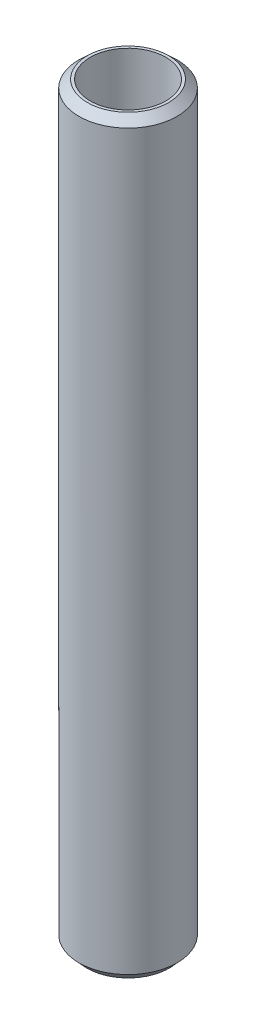
ISO-10303-21;
HEADER;
FILE_DESCRIPTION(('STEP AP214'),'2;1');
FILE_NAME('part.step','',(''),(''),'','','');
FILE_SCHEMA(('AUTOMOTIVE_DESIGN { 1 0 10303 214 1 1 1 1 }'));
ENDSEC;
DATA;
#1=APPLICATION_CONTEXT('core data for automotive mechanical design processes');
#2=APPLICATION_PROTOCOL_DEFINITION('international standard','automotive_design',2000,#1);
#3=PRODUCT_CONTEXT('',#1,'mechanical');
#4=PRODUCT('Part','Part','',(#3));
#5=PRODUCT_RELATED_PRODUCT_CATEGORY('part','',(#4));
#6=PRODUCT_DEFINITION_FORMATION('','',#4);
#7=PRODUCT_DEFINITION_CONTEXT('part definition',#1,'design');
#8=PRODUCT_DEFINITION('design','',#6,#7);
#9=PRODUCT_DEFINITION_SHAPE('','',#8);
#10=(LENGTH_UNIT() NAMED_UNIT(*) SI_UNIT(.MILLI.,.METRE.));
#11=(NAMED_UNIT(*) PLANE_ANGLE_UNIT() SI_UNIT($,.RADIAN.));
#12=(NAMED_UNIT(*) SI_UNIT($,.STERADIAN.) SOLID_ANGLE_UNIT());
#13=UNCERTAINTY_MEASURE_WITH_UNIT(LENGTH_MEASURE(1.E-05),#10,'distance_accuracy_value','');
#14=(GEOMETRIC_REPRESENTATION_CONTEXT(3) GLOBAL_UNCERTAINTY_ASSIGNED_CONTEXT((#13)) GLOBAL_UNIT_ASSIGNED_CONTEXT((#10,
#11,#12)) REPRESENTATION_CONTEXT('',''));
#15=CARTESIAN_POINT('',(0.,0.,0.));
#16=DIRECTION('',(0.,0.,1.));
#17=DIRECTION('',(1.,0.,0.));
#18=AXIS2_PLACEMENT_3D('',#15,#16,#17);
#19=CARTESIAN_POINT('',(0.,343.666464801404,0.));
#20=DIRECTION('',(0.,-1.,0.));
#21=DIRECTION('',(0.,0.,-1.));
#22=AXIS2_PLACEMENT_3D('',#19,#20,#21);
#23=CYLINDRICAL_SURFACE('',#22,22.5);
#24=CARTESIAN_POINT('',(0.,340.098776396544,0.));
#25=DIRECTION('',(0.,1.,0.));
#26=DIRECTION('',(0.,0.,1.));
#27=AXIS2_PLACEMENT_3D('',#24,#25,#26);
#28=CIRCLE('',#27,22.5);
#29=CARTESIAN_POINT('',(0.,340.098776396544,-22.5));
#30=VERTEX_POINT('',#29);
#31=EDGE_CURVE('E50',#30,#30,#28,.F.);
#32=CARTESIAN_POINT('',(0.,3.87043361719264,0.));
#33=DIRECTION('',(0.,1.,0.));
#34=DIRECTION('',(0.,0.,1.));
#35=AXIS2_PLACEMENT_3D('',#32,#33,#34);
#36=CIRCLE('',#35,22.5);
#37=CARTESIAN_POINT('',(0.,3.87043361719258,-22.5));
#38=VERTEX_POINT('',#37);
#39=EDGE_CURVE('E51',#38,#38,#36,.T.);
#40=CARTESIAN_POINT('',(0.,340.098776396544,-22.5));
#41=CARTESIAN_POINT('',(0.,336.596397825925,-22.5));
#42=CARTESIAN_POINT('',(0.,333.094019255307,-22.5));
#43=CARTESIAN_POINT('',(0.,326.089262114071,-22.5));
#44=CARTESIAN_POINT('',(0.,322.586883543452,-22.5));
#45=CARTESIAN_POINT('',(0.,315.582126402216,-22.5));
#46=CARTESIAN_POINT('',(0.,312.079747831598,-22.5));
#47=CARTESIAN_POINT('',(0.,305.074990690361,-22.5));
#48=CARTESIAN_POINT('',(0.,301.572612119743,-22.5));
#49=CARTESIAN_POINT('',(0.,294.567854978507,-22.5));
#50=CARTESIAN_POINT('',(0.,291.065476407888,-22.5));
#51=CARTESIAN_POINT('',(0.,284.060719266652,-22.5));
#52=CARTESIAN_POINT('',(0.,280.558340696034,-22.5));
#53=CARTESIAN_POINT('',(0.,273.553583554797,-22.5));
#54=CARTESIAN_POINT('',(0.,270.051204984179,-22.5));
#55=CARTESIAN_POINT('',(0.,263.046447842942,-22.5));
#56=CARTESIAN_POINT('',(0.,259.544069272324,-22.5));
#57=CARTESIAN_POINT('',(0.,252.539312131088,-22.5));
#58=CARTESIAN_POINT('',(0.,249.036933560469,-22.5));
#59=CARTESIAN_POINT('',(0.,242.032176419233,-22.5));
#60=CARTESIAN_POINT('',(0.,238.529797848615,-22.5));
#61=CARTESIAN_POINT('',(0.,231.525040707378,-22.5));
#62=CARTESIAN_POINT('',(0.,228.02266213676,-22.5));
#63=CARTESIAN_POINT('',(0.,221.017904995524,-22.5));
#64=CARTESIAN_POINT('',(0.,217.515526424905,-22.5));
#65=CARTESIAN_POINT('',(0.,210.510769283669,-22.5));
#66=CARTESIAN_POINT('',(0.,207.008390713051,-22.5));
#67=CARTESIAN_POINT('',(0.,200.003633571814,-22.5));
#68=CARTESIAN_POINT('',(0.,196.501255001196,-22.5));
#69=CARTESIAN_POINT('',(0.,189.496497859959,-22.5));
#70=CARTESIAN_POINT('',(0.,185.994119289341,-22.5));
#71=CARTESIAN_POINT('',(0.,178.989362148105,-22.5));
#72=CARTESIAN_POINT('',(0.,175.486983577486,-22.5));
#73=CARTESIAN_POINT('',(0.,168.48222643625,-22.5));
#74=CARTESIAN_POINT('',(0.,164.979847865632,-22.5));
#75=CARTESIAN_POINT('',(0.,157.975090724395,-22.5));
#76=CARTESIAN_POINT('',(0.,154.472712153777,-22.5));
#77=CARTESIAN_POINT('',(0.,147.46795501254,-22.5));
#78=CARTESIAN_POINT('',(0.,143.965576441922,-22.5));
#79=CARTESIAN_POINT('',(0.,136.960819300686,-22.5));
#80=CARTESIAN_POINT('',(0.,133.458440730068,-22.5));
#81=CARTESIAN_POINT('',(0.,126.453683588831,-22.5));
#82=CARTESIAN_POINT('',(0.,122.951305018213,-22.5));
#83=CARTESIAN_POINT('',(0.,115.946547876976,-22.5));
#84=CARTESIAN_POINT('',(0.,112.444169306358,-22.5));
#85=CARTESIAN_POINT('',(0.,105.439412165122,-22.5));
#86=CARTESIAN_POINT('',(0.,101.937033594503,-22.5));
#87=CARTESIAN_POINT('',(0.,94.9322764532669,-22.5));
#88=CARTESIAN_POINT('',(0.,91.4298978826486,-22.5));
#89=CARTESIAN_POINT('',(0.,84.4251407414121,-22.5));
#90=CARTESIAN_POINT('',(0.,80.9227621707939,-22.5));
#91=CARTESIAN_POINT('',(0.,73.9180050295574,-22.5));
#92=CARTESIAN_POINT('',(0.,70.4156264589392,-22.5));
#93=CARTESIAN_POINT('',(0.,63.4108693177027,-22.5));
#94=CARTESIAN_POINT('',(0.,59.9084907470844,-22.5));
#95=CARTESIAN_POINT('',(0.,52.903733605848,-22.5));
#96=CARTESIAN_POINT('',(0.,49.4013550352297,-22.5));
#97=CARTESIAN_POINT('',(0.,42.3965978939932,-22.5));
#98=CARTESIAN_POINT('',(0.,38.894219323375,-22.5));
#99=CARTESIAN_POINT('',(0.,31.8894621821385,-22.5));
#100=CARTESIAN_POINT('',(0.,28.3870836115203,-22.5));
#101=CARTESIAN_POINT('',(0.,21.3823264702838,-22.5));
#102=CARTESIAN_POINT('',(0.,17.8799478996656,-22.5));
#103=CARTESIAN_POINT('',(0.,10.8751907584291,-22.5));
#104=CARTESIAN_POINT('',(0.,7.37281218781083,-22.5));
#105=CARTESIAN_POINT('',(0.,3.87043361719258,-22.5));
#106=B_SPLINE_CURVE_WITH_KNOTS('',3,(#40,#41,#42,#43,#44,#45,#46,#47,#48,#49,#50,#51,#52,#53,
#54,#55,#56,#57,#58,#59,#60,#61,#62,#63,#64,#65,#66,#67,#68,#69,#70,#71,#72,#73,#74,#75,#76,#77,
#78,#79,#80,#81,#82,#83,#84,#85,#86,#87,#88,#89,#90,#91,#92,#93,#94,#95,#96,#97,#98,#99,#100,
#101,#102,#103,#104,#105),.UNSPECIFIED.,.F.,.F.,(4,2,2,2,2,2,2,2,2,2,2,2,2,2,2,2,2,2,2,2,2,2,2,
2,2,2,2,2,2,2,2,2,4),(0.,10.5071357118547,21.0142714237094,31.5214071355641,42.0285428474189,
52.5356785592736,63.0428142711283,73.549949982983,84.0570856948378,94.5642214066925,
105.071357118547,115.578492830402,126.085628542257,136.592764254111,147.099899965966,
157.607035677821,168.114171389676,178.62130710153,189.128442813385,199.63557852524,
210.142714237094,220.649849948949,231.156985660804,241.664121372659,252.171257084513,
262.678392796368,273.185528508223,283.692664220078,294.199799931932,304.706935643787,
315.214071355642,325.721207067496,336.228342779351),.UNSPECIFIED.);
#107=EDGE_CURVE('BSEAM39',#30,#38,#106,.T.);
#108=ORIENTED_EDGE('',*,*,#31,.T.);
#109=ORIENTED_EDGE('',*,*,#39,.T.);
#110=ORIENTED_EDGE('',*,*,#107,.T.);
#111=ORIENTED_EDGE('',*,*,#107,.F.);
#112=EDGE_LOOP('',(#108,#110,#109,#111));
#113=FACE_BOUND('',#112,.T.);
#114=ADVANCED_FACE('F39',(#113),#23,.T.);
#115=CARTESIAN_POINT('',(0.,343.666464801404,0.));
#116=DIRECTION('',(0.,1.,0.));
#117=DIRECTION('',(0.,0.,1.));
#118=AXIS2_PLACEMENT_3D('',#115,#116,#117);
#119=PLANE('',#118);
#120=CARTESIAN_POINT('',(0.,343.666464801404,0.));
#121=DIRECTION('',(0.,1.,0.));
#122=DIRECTION('',(0.,0.,1.));
#123=AXIS2_PLACEMENT_3D('',#120,#121,#122);
#124=CIRCLE('',#123,18.6295663828078);
#125=CARTESIAN_POINT('',(0.,343.666464801404,18.6295663828078));
#126=VERTEX_POINT('',#125);
#127=EDGE_CURVE('E54',#126,#126,#124,.T.);
#128=ORIENTED_EDGE('',*,*,#127,.T.);
#129=EDGE_LOOP('',(#128));
#130=FACE_BOUND('',#129,.T.);
#131=CARTESIAN_POINT('',(0.,343.666464801404,0.));
#132=DIRECTION('',(0.,1.,0.));
#133=DIRECTION('',(0.,0.,1.));
#134=AXIS2_PLACEMENT_3D('',#131,#132,#133);
#135=CIRCLE('',#134,17.361282438007);
#136=CARTESIAN_POINT('',(0.,343.666464801404,-17.361282438007));
#137=VERTEX_POINT('',#136);
#138=EDGE_CURVE('E58',#137,#137,#135,.T.);
#139=ORIENTED_EDGE('',*,*,#138,.F.);
#140=EDGE_LOOP('',(#139));
#141=FACE_BOUND('',#140,.T.);
#142=ADVANCED_FACE('F69',(#130,#141),#119,.T.);
#143=CARTESIAN_POINT('',(0.,0.,0.));
#144=DIRECTION('',(0.,1.,0.));
#145=DIRECTION('',(0.,0.,1.));
#146=AXIS2_PLACEMENT_3D('',#143,#144,#145);
#147=PLANE('',#146);
#148=CARTESIAN_POINT('',(0.,0.,0.));
#149=DIRECTION('',(0.,1.,0.));
#150=DIRECTION('',(0.,0.,1.));
#151=AXIS2_PLACEMENT_3D('',#148,#149,#150);
#152=CIRCLE('',#151,18.9323115951397);
#153=CARTESIAN_POINT('',(0.,0.,18.9323115951397));
#154=VERTEX_POINT('',#153);
#155=EDGE_CURVE('E10',#154,#154,#152,.F.);
#156=ORIENTED_EDGE('',*,*,#155,.T.);
#157=EDGE_LOOP('',(#156));
#158=FACE_BOUND('',#157,.T.);
#159=CARTESIAN_POINT('',(0.,0.,0.));
#160=DIRECTION('',(0.,1.,0.));
#161=DIRECTION('',(0.,0.,1.));
#162=AXIS2_PLACEMENT_3D('',#159,#160,#161);
#163=CIRCLE('',#162,17.361282438007);
#164=CARTESIAN_POINT('',(0.,0.,-17.361282438007));
#165=VERTEX_POINT('',#164);
#166=EDGE_CURVE('E63',#165,#165,#163,.T.);
#167=ORIENTED_EDGE('',*,*,#166,.T.);
#168=EDGE_LOOP('',(#167));
#169=FACE_BOUND('',#168,.T.);
#170=ADVANCED_FACE('F75',(#158,#169),#147,.F.);
#171=CARTESIAN_POINT('',(0.,343.666464801404,0.));
#172=DIRECTION('',(0.,-1.,0.));
#173=DIRECTION('',(0.,0.,-1.));
#174=AXIS2_PLACEMENT_3D('',#171,#172,#173);
#175=CYLINDRICAL_SURFACE('',#174,17.361282438007);
#176=CARTESIAN_POINT('',(0.,343.666464801404,-17.361282438007));
#177=CARTESIAN_POINT('',(0.,340.086605793056,-17.361282438007));
#178=CARTESIAN_POINT('',(0.,336.506746784708,-17.361282438007));
#179=CARTESIAN_POINT('',(0.,329.347028768012,-17.361282438007));
#180=CARTESIAN_POINT('',(0.,325.767169759664,-17.361282438007));
#181=CARTESIAN_POINT('',(0.,318.607451742968,-17.361282438007));
#182=CARTESIAN_POINT('',(0.,315.02759273462,-17.361282438007));
#183=CARTESIAN_POINT('',(0.,307.867874717924,-17.361282438007));
#184=CARTESIAN_POINT('',(0.,304.288015709576,-17.361282438007));
#185=CARTESIAN_POINT('',(0.,297.12829769288,-17.361282438007));
#186=CARTESIAN_POINT('',(0.,293.548438684532,-17.361282438007));
#187=CARTESIAN_POINT('',(0.,286.388720667836,-17.361282438007));
#188=CARTESIAN_POINT('',(0.,282.808861659488,-17.361282438007));
#189=CARTESIAN_POINT('',(0.,275.649143642792,-17.361282438007));
#190=CARTESIAN_POINT('',(0.,272.069284634445,-17.361282438007));
#191=CARTESIAN_POINT('',(0.,264.909566617749,-17.361282438007));
#192=CARTESIAN_POINT('',(0.,261.329707609401,-17.361282438007));
#193=CARTESIAN_POINT('',(0.,254.169989592705,-17.361282438007));
#194=CARTESIAN_POINT('',(0.,250.590130584357,-17.361282438007));
#195=CARTESIAN_POINT('',(0.,243.430412567661,-17.361282438007));
#196=CARTESIAN_POINT('',(0.,239.850553559313,-17.361282438007));
#197=CARTESIAN_POINT('',(0.,232.690835542617,-17.361282438007));
#198=CARTESIAN_POINT('',(0.,229.110976534269,-17.361282438007));
#199=CARTESIAN_POINT('',(0.,221.951258517573,-17.361282438007));
#200=CARTESIAN_POINT('',(0.,218.371399509225,-17.361282438007));
#201=CARTESIAN_POINT('',(0.,211.211681492529,-17.361282438007));
#202=CARTESIAN_POINT('',(0.,207.631822484181,-17.361282438007));
#203=CARTESIAN_POINT('',(0.,200.472104467485,-17.361282438007));
#204=CARTESIAN_POINT('',(0.,196.892245459137,-17.361282438007));
#205=CARTESIAN_POINT('',(0.,189.732527442442,-17.361282438007));
#206=CARTESIAN_POINT('',(0.,186.152668434094,-17.361282438007));
#207=CARTESIAN_POINT('',(0.,178.992950417398,-17.361282438007));
#208=CARTESIAN_POINT('',(0.,175.41309140905,-17.361282438007));
#209=CARTESIAN_POINT('',(0.,168.253373392354,-17.361282438007));
#210=CARTESIAN_POINT('',(0.,164.673514384006,-17.361282438007));
#211=CARTESIAN_POINT('',(0.,157.51379636731,-17.361282438007));
#212=CARTESIAN_POINT('',(0.,153.933937358962,-17.361282438007));
#213=CARTESIAN_POINT('',(0.,146.774219342266,-17.361282438007));
#214=CARTESIAN_POINT('',(0.,143.194360333918,-17.361282438007));
#215=CARTESIAN_POINT('',(0.,136.034642317222,-17.361282438007));
#216=CARTESIAN_POINT('',(0.,132.454783308874,-17.361282438007));
#217=CARTESIAN_POINT('',(0.,125.295065292178,-17.361282438007));
#218=CARTESIAN_POINT('',(0.,121.71520628383,-17.361282438007));
#219=CARTESIAN_POINT('',(0.,114.555488267134,-17.361282438007));
#220=CARTESIAN_POINT('',(0.,110.975629258787,-17.361282438007));
#221=CARTESIAN_POINT('',(0.,103.815911242091,-17.361282438007));
#222=CARTESIAN_POINT('',(0.,100.236052233743,-17.361282438007));
#223=CARTESIAN_POINT('',(0.,93.0763342170468,-17.361282438007));
#224=CARTESIAN_POINT('',(0.,89.4964752086988,-17.361282438007));
#225=CARTESIAN_POINT('',(0.,82.3367571920029,-17.361282438007));
#226=CARTESIAN_POINT('',(0.,78.7568981836549,-17.361282438007));
#227=CARTESIAN_POINT('',(0.,71.597180166959,-17.361282438007));
#228=CARTESIAN_POINT('',(0.,68.0173211586111,-17.361282438007));
#229=CARTESIAN_POINT('',(0.,60.8576031419152,-17.361282438007));
#230=CARTESIAN_POINT('',(0.,57.2777441335672,-17.361282438007));
#231=CARTESIAN_POINT('',(0.,50.1180261168713,-17.361282438007));
#232=CARTESIAN_POINT('',(0.,46.5381671085234,-17.361282438007));
#233=CARTESIAN_POINT('',(0.,39.3784490918274,-17.361282438007));
#234=CARTESIAN_POINT('',(0.,35.7985900834795,-17.361282438007));
#235=CARTESIAN_POINT('',(0.,28.6388720667836,-17.361282438007));
#236=CARTESIAN_POINT('',(0.,25.0590130584356,-17.361282438007));
#237=CARTESIAN_POINT('',(0.,17.8992950417397,-17.361282438007));
#238=CARTESIAN_POINT('',(0.,14.3194360333918,-17.361282438007));
#239=CARTESIAN_POINT('',(0.,7.15971801669585,-17.361282438007));
#240=CARTESIAN_POINT('',(0.,3.57985900834789,-17.361282438007));
#241=CARTESIAN_POINT('',(0.,0.,-17.361282438007));
#242=B_SPLINE_CURVE_WITH_KNOTS('',3,(#176,#177,#178,#179,#180,#181,#182,#183,#184,#185,#186,
#187,#188,#189,#190,#191,#192,#193,#194,#195,#196,#197,#198,#199,#200,#201,#202,#203,#204,#205,
#206,#207,#208,#209,#210,#211,#212,#213,#214,#215,#216,#217,#218,#219,#220,#221,#222,#223,#224,
#225,#226,#227,#228,#229,#230,#231,#232,#233,#234,#235,#236,#237,#238,#239,#240,#241),
.UNSPECIFIED.,.F.,.F.,(4,2,2,2,2,2,2,2,2,2,2,2,2,2,2,2,2,2,2,2,2,2,2,2,2,2,2,2,2,2,2,2,4),(0.,
10.7395770250439,21.4791540500877,32.2187310751316,42.9583081001754,53.6978851252193,
64.4374621502631,75.177039175307,85.9166162003509,96.6561932253948,107.395770250439,
118.135347275482,128.874924300526,139.61450132557,150.354078350614,161.093655375658,
171.833232400702,182.572809425746,193.31238645079,204.051963475833,214.791540500877,
225.531117525921,236.270694550965,247.010271576009,257.749848601053,268.489425626097,
279.22900265114,289.968579676184,300.708156701228,311.447733726272,322.187310751316,
332.92688777636,343.666464801404),.UNSPECIFIED.);
#243=EDGE_CURVE('BSEAM70',#137,#165,#242,.T.);
#244=ORIENTED_EDGE('',*,*,#138,.T.);
#245=ORIENTED_EDGE('',*,*,#166,.F.);
#246=ORIENTED_EDGE('',*,*,#243,.T.);
#247=ORIENTED_EDGE('',*,*,#243,.F.);
#248=EDGE_LOOP('',(#244,#246,#245,#247));
#249=FACE_BOUND('',#248,.T.);
#250=ADVANCED_FACE('F70',(#249),#175,.F.);
#251=CARTESIAN_POINT('',(0.,343.666464801404,0.));
#252=DIRECTION('',(0.,-1.,0.));
#253=DIRECTION('',(0.,0.,-1.));
#254=AXIS2_PLACEMENT_3D('',#251,#252,#253);
#255=CONICAL_SURFACE('',#254,18.6295663828078,0.82607754423264);
#256=ORIENTED_EDGE('',*,*,#31,.F.);
#257=EDGE_LOOP('',(#256));
#258=FACE_BOUND('',#257,.T.);
#259=ORIENTED_EDGE('',*,*,#127,.F.);
#260=EDGE_LOOP('',(#259));
#261=FACE_BOUND('',#260,.T.);
#262=ADVANCED_FACE('F81',(#258,#261),#255,.T.);
#263=CARTESIAN_POINT('',(0.,3.87043361719264,0.));
#264=DIRECTION('',(0.,1.,0.));
#265=DIRECTION('',(0.,0.,1.));
#266=AXIS2_PLACEMENT_3D('',#263,#264,#265);
#267=CONICAL_SURFACE('',#266,22.5,0.744718782562262);
#268=ORIENTED_EDGE('',*,*,#155,.F.);
#269=EDGE_LOOP('',(#268));
#270=FACE_BOUND('',#269,.T.);
#271=ORIENTED_EDGE('',*,*,#39,.F.);
#272=EDGE_LOOP('',(#271));
#273=FACE_BOUND('',#272,.T.);
#274=ADVANCED_FACE('F45',(#270,#273),#267,.T.);
#275=CLOSED_SHELL('',(#114,#142,#170,#250,#262,#274));
#276=MANIFOLD_SOLID_BREP('B2',#275);
#277=ADVANCED_BREP_SHAPE_REPRESENTATION('',(#18,#276),#14);
#278=SHAPE_DEFINITION_REPRESENTATION(#9,#277);
ENDSEC;
END-ISO-10303-21;
